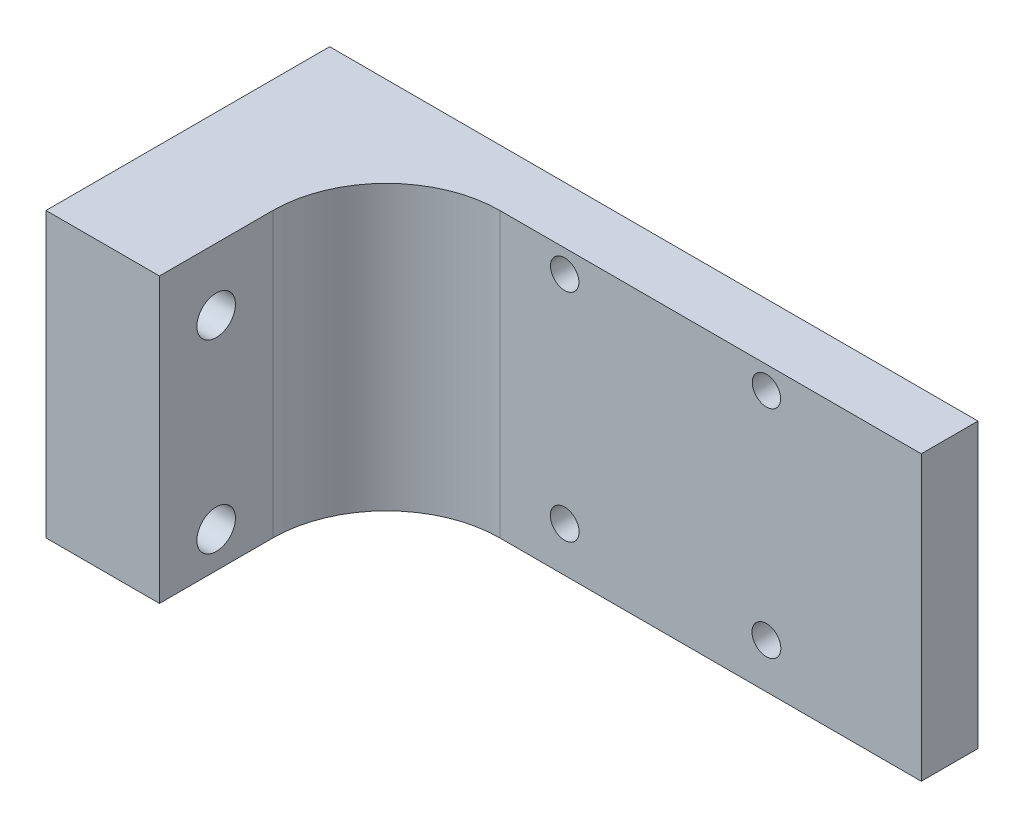
ISO-10303-21;
HEADER;
FILE_DESCRIPTION(('STEP AP214'),'2;1');
FILE_NAME('part.step','',(''),(''),'','','');
FILE_SCHEMA(('AUTOMOTIVE_DESIGN { 1 0 10303 214 1 1 1 1 }'));
ENDSEC;
DATA;
#1=APPLICATION_CONTEXT('core data for automotive mechanical design processes');
#2=APPLICATION_PROTOCOL_DEFINITION('international standard','automotive_design',2000,#1);
#3=PRODUCT_CONTEXT('',#1,'mechanical');
#4=PRODUCT('Part','Part','',(#3));
#5=PRODUCT_RELATED_PRODUCT_CATEGORY('part','',(#4));
#6=PRODUCT_DEFINITION_FORMATION('','',#4);
#7=PRODUCT_DEFINITION_CONTEXT('part definition',#1,'design');
#8=PRODUCT_DEFINITION('design','',#6,#7);
#9=PRODUCT_DEFINITION_SHAPE('','',#8);
#10=(LENGTH_UNIT() NAMED_UNIT(*) SI_UNIT(.MILLI.,.METRE.));
#11=(NAMED_UNIT(*) PLANE_ANGLE_UNIT() SI_UNIT($,.RADIAN.));
#12=(NAMED_UNIT(*) SI_UNIT($,.STERADIAN.) SOLID_ANGLE_UNIT());
#13=UNCERTAINTY_MEASURE_WITH_UNIT(LENGTH_MEASURE(1.E-05),#10,'distance_accuracy_value','');
#14=(GEOMETRIC_REPRESENTATION_CONTEXT(3) GLOBAL_UNCERTAINTY_ASSIGNED_CONTEXT((#13)) GLOBAL_UNIT_ASSIGNED_CONTEXT((#10,
#11,#12)) REPRESENTATION_CONTEXT('',''));
#15=CARTESIAN_POINT('',(0.,0.,0.));
#16=DIRECTION('',(0.,0.,1.));
#17=DIRECTION('',(1.,0.,0.));
#18=AXIS2_PLACEMENT_3D('',#15,#16,#17);
#19=CARTESIAN_POINT('',(0.,0.,5.));
#20=DIRECTION('',(1.,0.,0.));
#21=DIRECTION('',(0.,1.,0.));
#22=AXIS2_PLACEMENT_3D('',#19,#20,#21);
#23=PLANE('',#22);
#24=CARTESIAN_POINT('',(0.,-21.8349192381209,20.));
#25=DIRECTION('',(1.,0.,0.));
#26=DIRECTION('',(0.,1.,0.));
#27=AXIS2_PLACEMENT_3D('',#24,#25,#26);
#28=CIRCLE('',#27,1.7);
#29=CARTESIAN_POINT('',(0.,-20.1349192381209,20.));
#30=VERTEX_POINT('',#29);
#31=EDGE_CURVE('E120',#30,#30,#28,.T.);
#32=ORIENTED_EDGE('',*,*,#31,.T.);
#33=EDGE_LOOP('',(#32));
#34=FACE_BOUND('',#33,.T.);
#35=CARTESIAN_POINT('',(0.,-5.50310841636206,20.));
#36=DIRECTION('',(1.,0.,0.));
#37=DIRECTION('',(0.,1.,0.));
#38=AXIS2_PLACEMENT_3D('',#35,#36,#37);
#39=CIRCLE('',#38,1.7);
#40=CARTESIAN_POINT('',(0.,-3.80310841636206,20.));
#41=VERTEX_POINT('',#40);
#42=EDGE_CURVE('E279',#41,#41,#39,.T.);
#43=ORIENTED_EDGE('',*,*,#42,.T.);
#44=EDGE_LOOP('',(#43));
#45=FACE_BOUND('',#44,.T.);
#46=DIRECTION('',(0.,-1.,0.));
#47=VECTOR('',#46,1.);
#48=CARTESIAN_POINT('',(0.,0.,0.));
#49=LINE('',#48,#47);
#50=CARTESIAN_POINT('',(0.,0.,0.));
#51=VERTEX_POINT('',#50);
#52=CARTESIAN_POINT('',(0.,-25.,0.));
#53=VERTEX_POINT('',#52);
#54=EDGE_CURVE('E162',#51,#53,#49,.T.);
#55=ORIENTED_EDGE('',*,*,#54,.T.);
#56=DIRECTION('',(0.,0.,-1.));
#57=VECTOR('',#56,1.);
#58=CARTESIAN_POINT('',(0.,-25.,5.));
#59=LINE('',#58,#57);
#60=CARTESIAN_POINT('',(0.,-25.,25.));
#61=VERTEX_POINT('',#60);
#62=EDGE_CURVE('E197',#61,#53,#59,.T.);
#63=ORIENTED_EDGE('',*,*,#62,.F.);
#64=DIRECTION('',(0.,-1.,0.));
#65=VECTOR('',#64,1.);
#66=CARTESIAN_POINT('',(0.,0.,25.));
#67=LINE('',#66,#65);
#68=CARTESIAN_POINT('',(0.,0.,25.));
#69=VERTEX_POINT('',#68);
#70=EDGE_CURVE('E109',#69,#61,#67,.T.);
#71=ORIENTED_EDGE('',*,*,#70,.F.);
#72=DIRECTION('',(0.,0.,-1.));
#73=VECTOR('',#72,1.);
#74=CARTESIAN_POINT('',(0.,0.,5.));
#75=LINE('',#74,#73);
#76=EDGE_CURVE('E104',#69,#51,#75,.T.);
#77=ORIENTED_EDGE('',*,*,#76,.T.);
#78=EDGE_LOOP('',(#55,#63,#71,#77));
#79=FACE_BOUND('',#78,.T.);
#80=ADVANCED_FACE('F41',(#34,#45,#79),#23,.F.);
#81=CARTESIAN_POINT('',(0.,-25.,5.));
#82=DIRECTION('',(0.,1.,0.));
#83=DIRECTION('',(0.,0.,1.));
#84=AXIS2_PLACEMENT_3D('',#81,#82,#83);
#85=PLANE('',#84);
#86=DIRECTION('',(1.,0.,0.));
#87=VECTOR('',#86,1.);
#88=CARTESIAN_POINT('',(0.,-25.,0.));
#89=LINE('',#88,#87);
#90=CARTESIAN_POINT('',(57.15,-25.,0.));
#91=VERTEX_POINT('',#90);
#92=EDGE_CURVE('E179',#53,#91,#89,.T.);
#93=ORIENTED_EDGE('',*,*,#92,.T.);
#94=DIRECTION('',(0.,0.,-1.));
#95=VECTOR('',#94,1.);
#96=CARTESIAN_POINT('',(57.15,-25.,5.));
#97=LINE('',#96,#95);
#98=CARTESIAN_POINT('',(57.15,-25.,5.));
#99=VERTEX_POINT('',#98);
#100=EDGE_CURVE('E193',#99,#91,#97,.T.);
#101=ORIENTED_EDGE('',*,*,#100,.F.);
#102=DIRECTION('',(1.,0.,0.));
#103=VECTOR('',#102,1.);
#104=CARTESIAN_POINT('',(0.,-25.,5.));
#105=LINE('',#104,#103);
#106=CARTESIAN_POINT('',(20.,-25.,5.));
#107=VERTEX_POINT('',#106);
#108=EDGE_CURVE('E166',#107,#99,#105,.T.);
#109=ORIENTED_EDGE('',*,*,#108,.F.);
#110=CARTESIAN_POINT('',(20.,-25.,15.));
#111=DIRECTION('',(0.,1.,0.));
#112=DIRECTION('',(0.,0.,1.));
#113=AXIS2_PLACEMENT_3D('',#110,#111,#112);
#114=CIRCLE('',#113,10.);
#115=CARTESIAN_POINT('',(10.,-25.,15.));
#116=VERTEX_POINT('',#115);
#117=EDGE_CURVE('E11',#107,#116,#114,.T.);
#118=ORIENTED_EDGE('',*,*,#117,.T.);
#119=DIRECTION('',(0.,0.,-1.));
#120=VECTOR('',#119,1.);
#121=CARTESIAN_POINT('',(10.,-25.,25.));
#122=LINE('',#121,#120);
#123=CARTESIAN_POINT('',(10.,-25.,25.));
#124=VERTEX_POINT('',#123);
#125=EDGE_CURVE('E128',#124,#116,#122,.T.);
#126=ORIENTED_EDGE('',*,*,#125,.F.);
#127=DIRECTION('',(1.,0.,0.));
#128=VECTOR('',#127,1.);
#129=CARTESIAN_POINT('',(0.,-25.,25.));
#130=LINE('',#129,#128);
#131=EDGE_CURVE('E115',#61,#124,#130,.T.);
#132=ORIENTED_EDGE('',*,*,#131,.F.);
#133=ORIENTED_EDGE('',*,*,#62,.T.);
#134=EDGE_LOOP('',(#93,#101,#109,#118,#126,#132,#133));
#135=FACE_BOUND('',#134,.T.);
#136=ADVANCED_FACE('F206',(#135),#85,.F.);
#137=CARTESIAN_POINT('',(57.15,0.,5.));
#138=DIRECTION('',(-1.,0.,0.));
#139=DIRECTION('',(0.,0.,1.));
#140=AXIS2_PLACEMENT_3D('',#137,#138,#139);
#141=PLANE('',#140);
#142=DIRECTION('',(0.,1.,0.));
#143=VECTOR('',#142,1.);
#144=CARTESIAN_POINT('',(57.15,0.,0.));
#145=LINE('',#144,#143);
#146=CARTESIAN_POINT('',(57.15,0.,0.));
#147=VERTEX_POINT('',#146);
#148=EDGE_CURVE('E182',#91,#147,#145,.T.);
#149=ORIENTED_EDGE('',*,*,#148,.T.);
#150=DIRECTION('',(0.,0.,-1.));
#151=VECTOR('',#150,1.);
#152=CARTESIAN_POINT('',(57.15,0.,5.));
#153=LINE('',#152,#151);
#154=CARTESIAN_POINT('',(57.15,0.,5.));
#155=VERTEX_POINT('',#154);
#156=EDGE_CURVE('E189',#155,#147,#153,.T.);
#157=ORIENTED_EDGE('',*,*,#156,.F.);
#158=DIRECTION('',(0.,1.,0.));
#159=VECTOR('',#158,1.);
#160=CARTESIAN_POINT('',(57.15,0.,5.));
#161=LINE('',#160,#159);
#162=EDGE_CURVE('E169',#99,#155,#161,.T.);
#163=ORIENTED_EDGE('',*,*,#162,.F.);
#164=ORIENTED_EDGE('',*,*,#100,.T.);
#165=EDGE_LOOP('',(#149,#157,#163,#164));
#166=FACE_BOUND('',#165,.T.);
#167=ADVANCED_FACE('F216',(#166),#141,.F.);
#168=CARTESIAN_POINT('',(0.,0.,5.));
#169=DIRECTION('',(0.,-1.,0.));
#170=DIRECTION('',(0.,0.,-1.));
#171=AXIS2_PLACEMENT_3D('',#168,#169,#170);
#172=PLANE('',#171);
#173=DIRECTION('',(-1.,0.,0.));
#174=VECTOR('',#173,1.);
#175=CARTESIAN_POINT('',(0.,0.,0.));
#176=LINE('',#175,#174);
#177=EDGE_CURVE('E170',#147,#51,#176,.T.);
#178=ORIENTED_EDGE('',*,*,#177,.T.);
#179=ORIENTED_EDGE('',*,*,#76,.F.);
#180=DIRECTION('',(-1.,0.,0.));
#181=VECTOR('',#180,1.);
#182=CARTESIAN_POINT('',(0.,0.,25.));
#183=LINE('',#182,#181);
#184=CARTESIAN_POINT('',(10.,0.,25.));
#185=VERTEX_POINT('',#184);
#186=EDGE_CURVE('E98',#185,#69,#183,.T.);
#187=ORIENTED_EDGE('',*,*,#186,.F.);
#188=DIRECTION('',(0.,0.,-1.));
#189=VECTOR('',#188,1.);
#190=CARTESIAN_POINT('',(10.,0.,25.));
#191=LINE('',#190,#189);
#192=CARTESIAN_POINT('',(10.,0.,15.));
#193=VERTEX_POINT('',#192);
#194=EDGE_CURVE('E102',#185,#193,#191,.T.);
#195=ORIENTED_EDGE('',*,*,#194,.T.);
#196=CARTESIAN_POINT('',(20.,0.,15.));
#197=DIRECTION('',(0.,-1.,0.));
#198=DIRECTION('',(0.,0.,-1.));
#199=AXIS2_PLACEMENT_3D('',#196,#197,#198);
#200=CIRCLE('',#199,10.);
#201=CARTESIAN_POINT('',(20.,0.,5.));
#202=VERTEX_POINT('',#201);
#203=EDGE_CURVE('E50',#193,#202,#200,.T.);
#204=ORIENTED_EDGE('',*,*,#203,.T.);
#205=DIRECTION('',(-1.,0.,0.));
#206=VECTOR('',#205,1.);
#207=CARTESIAN_POINT('',(0.,0.,5.));
#208=LINE('',#207,#206);
#209=EDGE_CURVE('E173',#155,#202,#208,.T.);
#210=ORIENTED_EDGE('',*,*,#209,.F.);
#211=ORIENTED_EDGE('',*,*,#156,.T.);
#212=EDGE_LOOP('',(#178,#179,#187,#195,#204,#210,#211));
#213=FACE_BOUND('',#212,.T.);
#214=ADVANCED_FACE('F100',(#213),#172,.F.);
#215=CARTESIAN_POINT('',(0.,0.,5.));
#216=DIRECTION('',(0.,0.,1.));
#217=DIRECTION('',(1.,0.,0.));
#218=AXIS2_PLACEMENT_3D('',#215,#216,#217);
#219=PLANE('',#218);
#220=ORIENTED_EDGE('',*,*,#209,.T.);
#221=DIRECTION('',(0.,1.,0.));
#222=VECTOR('',#221,1.);
#223=CARTESIAN_POINT('',(20.,0.,5.));
#224=LINE('',#223,#222);
#225=EDGE_CURVE('E63',#202,#107,#224,.F.);
#226=ORIENTED_EDGE('',*,*,#225,.T.);
#227=ORIENTED_EDGE('',*,*,#108,.T.);
#228=ORIENTED_EDGE('',*,*,#162,.T.);
#229=EDGE_LOOP('',(#220,#226,#227,#228));
#230=FACE_BOUND('',#229,.T.);
#231=CARTESIAN_POINT('',(43.5,-2.,5.));
#232=DIRECTION('',(0.,0.,1.));
#233=DIRECTION('',(1.,0.,0.));
#234=AXIS2_PLACEMENT_3D('',#231,#232,#233);
#235=CIRCLE('',#234,1.25);
#236=CARTESIAN_POINT('',(44.75,-2.,5.));
#237=VERTEX_POINT('',#236);
#238=EDGE_CURVE('E147',#237,#237,#235,.T.);
#239=ORIENTED_EDGE('',*,*,#238,.F.);
#240=EDGE_LOOP('',(#239));
#241=FACE_BOUND('',#240,.T.);
#242=CARTESIAN_POINT('',(25.72,-21.05,5.));
#243=DIRECTION('',(0.,0.,1.));
#244=DIRECTION('',(1.,0.,0.));
#245=AXIS2_PLACEMENT_3D('',#242,#243,#244);
#246=CIRCLE('',#245,1.27);
#247=CARTESIAN_POINT('',(26.99,-21.05,5.));
#248=VERTEX_POINT('',#247);
#249=EDGE_CURVE('E140',#248,#248,#246,.T.);
#250=ORIENTED_EDGE('',*,*,#249,.F.);
#251=EDGE_LOOP('',(#250));
#252=FACE_BOUND('',#251,.T.);
#253=CARTESIAN_POINT('',(43.5,-21.05,5.));
#254=DIRECTION('',(0.,0.,1.));
#255=DIRECTION('',(1.,0.,0.));
#256=AXIS2_PLACEMENT_3D('',#253,#254,#255);
#257=CIRCLE('',#256,1.27);
#258=CARTESIAN_POINT('',(44.77,-21.05,5.));
#259=VERTEX_POINT('',#258);
#260=EDGE_CURVE('E127',#259,#259,#257,.T.);
#261=ORIENTED_EDGE('',*,*,#260,.F.);
#262=EDGE_LOOP('',(#261));
#263=FACE_BOUND('',#262,.T.);
#264=CARTESIAN_POINT('',(25.72,-2.,5.));
#265=DIRECTION('',(0.,0.,1.));
#266=DIRECTION('',(1.,0.,0.));
#267=AXIS2_PLACEMENT_3D('',#264,#265,#266);
#268=CIRCLE('',#267,1.25);
#269=CARTESIAN_POINT('',(26.97,-2.,5.));
#270=VERTEX_POINT('',#269);
#271=EDGE_CURVE('E146',#270,#270,#268,.T.);
#272=ORIENTED_EDGE('',*,*,#271,.F.);
#273=EDGE_LOOP('',(#272));
#274=FACE_BOUND('',#273,.T.);
#275=ADVANCED_FACE('F218',(#230,#241,#252,#263,#274),#219,.T.);
#276=CARTESIAN_POINT('',(0.,0.,0.));
#277=DIRECTION('',(0.,0.,1.));
#278=DIRECTION('',(1.,0.,0.));
#279=AXIS2_PLACEMENT_3D('',#276,#277,#278);
#280=PLANE('',#279);
#281=CARTESIAN_POINT('',(43.5,-2.,0.));
#282=DIRECTION('',(0.,0.,1.));
#283=DIRECTION('',(1.,0.,0.));
#284=AXIS2_PLACEMENT_3D('',#281,#282,#283);
#285=CIRCLE('',#284,1.25);
#286=CARTESIAN_POINT('',(44.75,-2.,0.));
#287=VERTEX_POINT('',#286);
#288=EDGE_CURVE('E142',#287,#287,#285,.T.);
#289=ORIENTED_EDGE('',*,*,#288,.T.);
#290=EDGE_LOOP('',(#289));
#291=FACE_BOUND('',#290,.T.);
#292=CARTESIAN_POINT('',(25.72,-21.05,0.));
#293=DIRECTION('',(0.,0.,1.));
#294=DIRECTION('',(1.,0.,0.));
#295=AXIS2_PLACEMENT_3D('',#292,#293,#294);
#296=CIRCLE('',#295,1.27);
#297=CARTESIAN_POINT('',(26.99,-21.05,0.));
#298=VERTEX_POINT('',#297);
#299=EDGE_CURVE('E151',#298,#298,#296,.T.);
#300=ORIENTED_EDGE('',*,*,#299,.T.);
#301=EDGE_LOOP('',(#300));
#302=FACE_BOUND('',#301,.T.);
#303=CARTESIAN_POINT('',(43.5,-21.05,0.));
#304=DIRECTION('',(0.,0.,1.));
#305=DIRECTION('',(1.,0.,0.));
#306=AXIS2_PLACEMENT_3D('',#303,#304,#305);
#307=CIRCLE('',#306,1.27);
#308=CARTESIAN_POINT('',(44.77,-21.05,0.));
#309=VERTEX_POINT('',#308);
#310=EDGE_CURVE('E133',#309,#309,#307,.T.);
#311=ORIENTED_EDGE('',*,*,#310,.T.);
#312=EDGE_LOOP('',(#311));
#313=FACE_BOUND('',#312,.T.);
#314=CARTESIAN_POINT('',(25.72,-2.,0.));
#315=DIRECTION('',(0.,0.,1.));
#316=DIRECTION('',(1.,0.,0.));
#317=AXIS2_PLACEMENT_3D('',#314,#315,#316);
#318=CIRCLE('',#317,1.25);
#319=CARTESIAN_POINT('',(26.97,-2.,0.));
#320=VERTEX_POINT('',#319);
#321=EDGE_CURVE('E158',#320,#320,#318,.T.);
#322=ORIENTED_EDGE('',*,*,#321,.T.);
#323=EDGE_LOOP('',(#322));
#324=FACE_BOUND('',#323,.T.);
#325=ORIENTED_EDGE('',*,*,#54,.F.);
#326=ORIENTED_EDGE('',*,*,#177,.F.);
#327=ORIENTED_EDGE('',*,*,#148,.F.);
#328=ORIENTED_EDGE('',*,*,#92,.F.);
#329=EDGE_LOOP('',(#325,#326,#327,#328));
#330=FACE_BOUND('',#329,.T.);
#331=ADVANCED_FACE('F212',(#291,#302,#313,#324,#330),#280,.F.);
#332=CARTESIAN_POINT('',(25.72,-2.,0.));
#333=DIRECTION('',(0.,0.,1.));
#334=DIRECTION('',(1.,0.,0.));
#335=AXIS2_PLACEMENT_3D('',#332,#333,#334);
#336=CYLINDRICAL_SURFACE('',#335,1.25);
#337=ORIENTED_EDGE('',*,*,#321,.F.);
#338=EDGE_LOOP('',(#337));
#339=FACE_BOUND('',#338,.T.);
#340=ORIENTED_EDGE('',*,*,#271,.T.);
#341=EDGE_LOOP('',(#340));
#342=FACE_BOUND('',#341,.T.);
#343=ADVANCED_FACE('F247',(#339,#342),#336,.F.);
#344=CARTESIAN_POINT('',(43.5,-21.05,0.));
#345=DIRECTION('',(0.,0.,1.));
#346=DIRECTION('',(1.,0.,0.));
#347=AXIS2_PLACEMENT_3D('',#344,#345,#346);
#348=CYLINDRICAL_SURFACE('',#347,1.27);
#349=ORIENTED_EDGE('',*,*,#310,.F.);
#350=EDGE_LOOP('',(#349));
#351=FACE_BOUND('',#350,.T.);
#352=ORIENTED_EDGE('',*,*,#260,.T.);
#353=EDGE_LOOP('',(#352));
#354=FACE_BOUND('',#353,.T.);
#355=ADVANCED_FACE('F253',(#351,#354),#348,.F.);
#356=CARTESIAN_POINT('',(25.72,-21.05,0.));
#357=DIRECTION('',(0.,0.,1.));
#358=DIRECTION('',(1.,0.,0.));
#359=AXIS2_PLACEMENT_3D('',#356,#357,#358);
#360=CYLINDRICAL_SURFACE('',#359,1.27);
#361=ORIENTED_EDGE('',*,*,#299,.F.);
#362=EDGE_LOOP('',(#361));
#363=FACE_BOUND('',#362,.T.);
#364=ORIENTED_EDGE('',*,*,#249,.T.);
#365=EDGE_LOOP('',(#364));
#366=FACE_BOUND('',#365,.T.);
#367=ADVANCED_FACE('F255',(#363,#366),#360,.F.);
#368=CARTESIAN_POINT('',(43.5,-2.,0.));
#369=DIRECTION('',(0.,0.,1.));
#370=DIRECTION('',(1.,0.,0.));
#371=AXIS2_PLACEMENT_3D('',#368,#369,#370);
#372=CYLINDRICAL_SURFACE('',#371,1.25);
#373=ORIENTED_EDGE('',*,*,#288,.F.);
#374=EDGE_LOOP('',(#373));
#375=FACE_BOUND('',#374,.T.);
#376=ORIENTED_EDGE('',*,*,#238,.T.);
#377=EDGE_LOOP('',(#376));
#378=FACE_BOUND('',#377,.T.);
#379=ADVANCED_FACE('F258',(#375,#378),#372,.F.);
#380=CARTESIAN_POINT('',(10.,0.,25.));
#381=DIRECTION('',(-1.,0.,0.));
#382=DIRECTION('',(0.,-1.,0.));
#383=AXIS2_PLACEMENT_3D('',#380,#381,#382);
#384=PLANE('',#383);
#385=CARTESIAN_POINT('',(10.,-21.8349192381209,20.));
#386=DIRECTION('',(1.,0.,0.));
#387=DIRECTION('',(0.,1.,0.));
#388=AXIS2_PLACEMENT_3D('',#385,#386,#387);
#389=CIRCLE('',#388,1.7);
#390=CARTESIAN_POINT('',(10.,-20.1349192381209,20.));
#391=VERTEX_POINT('',#390);
#392=EDGE_CURVE('E277',#391,#391,#389,.T.);
#393=ORIENTED_EDGE('',*,*,#392,.F.);
#394=EDGE_LOOP('',(#393));
#395=FACE_BOUND('',#394,.T.);
#396=CARTESIAN_POINT('',(10.,-5.50310841636205,20.));
#397=DIRECTION('',(1.,0.,0.));
#398=DIRECTION('',(0.,1.,0.));
#399=AXIS2_PLACEMENT_3D('',#396,#397,#398);
#400=CIRCLE('',#399,1.7);
#401=CARTESIAN_POINT('',(10.,-3.80310841636205,20.));
#402=VERTEX_POINT('',#401);
#403=EDGE_CURVE('E285',#402,#402,#400,.T.);
#404=ORIENTED_EDGE('',*,*,#403,.F.);
#405=EDGE_LOOP('',(#404));
#406=FACE_BOUND('',#405,.T.);
#407=ORIENTED_EDGE('',*,*,#125,.T.);
#408=DIRECTION('',(0.,1.,0.));
#409=VECTOR('',#408,1.);
#410=CARTESIAN_POINT('',(10.,0.,15.));
#411=LINE('',#410,#409);
#412=EDGE_CURVE('E125',#116,#193,#411,.T.);
#413=ORIENTED_EDGE('',*,*,#412,.T.);
#414=ORIENTED_EDGE('',*,*,#194,.F.);
#415=DIRECTION('',(0.,1.,0.));
#416=VECTOR('',#415,1.);
#417=CARTESIAN_POINT('',(10.,0.,25.));
#418=LINE('',#417,#416);
#419=EDGE_CURVE('E110',#124,#185,#418,.T.);
#420=ORIENTED_EDGE('',*,*,#419,.F.);
#421=EDGE_LOOP('',(#407,#413,#414,#420));
#422=FACE_BOUND('',#421,.T.);
#423=ADVANCED_FACE('F123',(#395,#406,#422),#384,.F.);
#424=CARTESIAN_POINT('',(0.,0.,25.));
#425=DIRECTION('',(0.,0.,1.));
#426=DIRECTION('',(1.,0.,0.));
#427=AXIS2_PLACEMENT_3D('',#424,#425,#426);
#428=PLANE('',#427);
#429=ORIENTED_EDGE('',*,*,#419,.T.);
#430=ORIENTED_EDGE('',*,*,#186,.T.);
#431=ORIENTED_EDGE('',*,*,#70,.T.);
#432=ORIENTED_EDGE('',*,*,#131,.T.);
#433=EDGE_LOOP('',(#429,#430,#431,#432));
#434=FACE_BOUND('',#433,.T.);
#435=ADVANCED_FACE('F113',(#434),#428,.T.);
#436=CARTESIAN_POINT('',(20.,0.,15.));
#437=DIRECTION('',(0.,1.,0.));
#438=DIRECTION('',(-1.,0.,0.));
#439=AXIS2_PLACEMENT_3D('',#436,#437,#438);
#440=CYLINDRICAL_SURFACE('',#439,10.);
#441=ORIENTED_EDGE('',*,*,#117,.F.);
#442=ORIENTED_EDGE('',*,*,#225,.F.);
#443=ORIENTED_EDGE('',*,*,#203,.F.);
#444=ORIENTED_EDGE('',*,*,#412,.F.);
#445=EDGE_LOOP('',(#441,#442,#443,#444));
#446=FACE_BOUND('',#445,.T.);
#447=ADVANCED_FACE('F43',(#446),#440,.F.);
#448=CARTESIAN_POINT('',(0.,-5.50310841636206,20.));
#449=DIRECTION('',(1.,0.,0.));
#450=DIRECTION('',(0.,1.,0.));
#451=AXIS2_PLACEMENT_3D('',#448,#449,#450);
#452=CYLINDRICAL_SURFACE('',#451,1.7);
#453=ORIENTED_EDGE('',*,*,#42,.F.);
#454=EDGE_LOOP('',(#453));
#455=FACE_BOUND('',#454,.T.);
#456=ORIENTED_EDGE('',*,*,#403,.T.);
#457=EDGE_LOOP('',(#456));
#458=FACE_BOUND('',#457,.T.);
#459=ADVANCED_FACE('F223',(#455,#458),#452,.F.);
#460=CARTESIAN_POINT('',(0.,-21.8349192381209,20.));
#461=DIRECTION('',(1.,0.,0.));
#462=DIRECTION('',(0.,1.,0.));
#463=AXIS2_PLACEMENT_3D('',#460,#461,#462);
#464=CYLINDRICAL_SURFACE('',#463,1.7);
#465=ORIENTED_EDGE('',*,*,#31,.F.);
#466=EDGE_LOOP('',(#465));
#467=FACE_BOUND('',#466,.T.);
#468=ORIENTED_EDGE('',*,*,#392,.T.);
#469=EDGE_LOOP('',(#468));
#470=FACE_BOUND('',#469,.T.);
#471=ADVANCED_FACE('F228',(#467,#470),#464,.F.);
#472=CLOSED_SHELL('',(#80,#136,#167,#214,#275,#331,#343,#355,#367,#379,#423,#435,#447,#459,#471));
#473=MANIFOLD_SOLID_BREP('B2',#472);
#474=ADVANCED_BREP_SHAPE_REPRESENTATION('',(#18,#473),#14);
#475=SHAPE_DEFINITION_REPRESENTATION(#9,#474);
ENDSEC;
END-ISO-10303-21;
